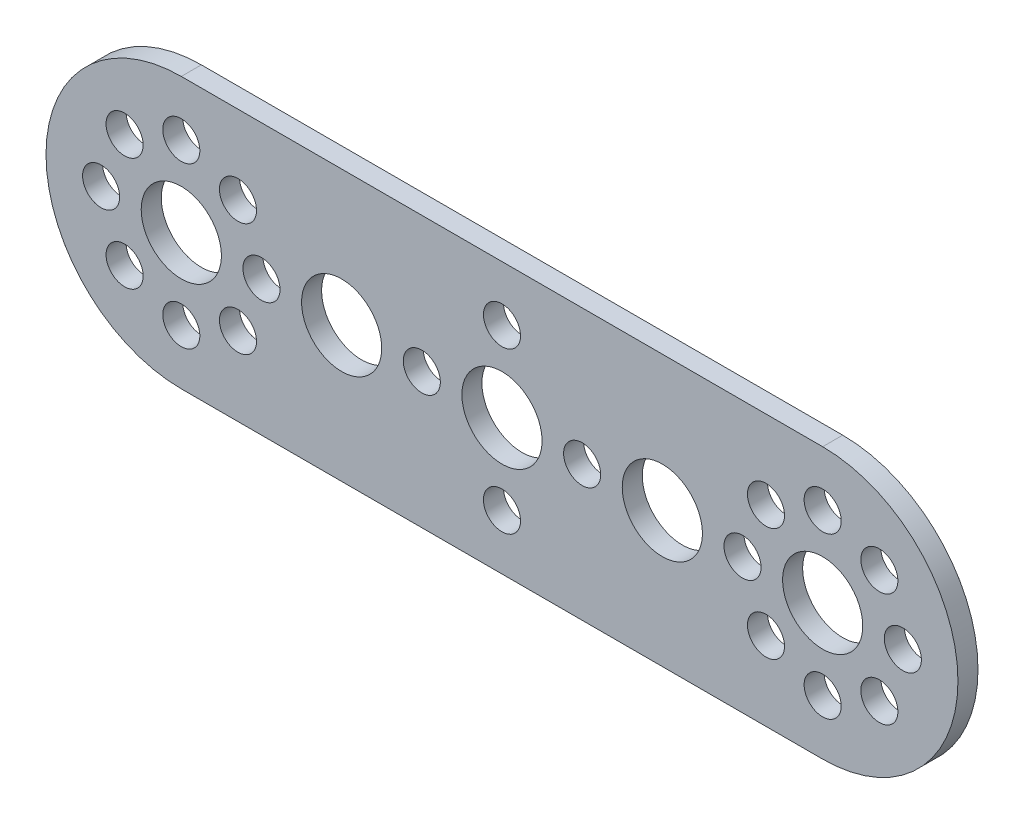
ISO-10303-21;
HEADER;
FILE_DESCRIPTION(('STEP AP214'),'2;1');
FILE_NAME('part.step','',(''),(''),'','','');
FILE_SCHEMA(('AUTOMOTIVE_DESIGN { 1 0 10303 214 1 1 1 1 }'));
ENDSEC;
DATA;
#1=APPLICATION_CONTEXT('core data for automotive mechanical design processes');
#2=APPLICATION_PROTOCOL_DEFINITION('international standard','automotive_design',2000,#1);
#3=PRODUCT_CONTEXT('',#1,'mechanical');
#4=PRODUCT('Part','Part','',(#3));
#5=PRODUCT_RELATED_PRODUCT_CATEGORY('part','',(#4));
#6=PRODUCT_DEFINITION_FORMATION('','',#4);
#7=PRODUCT_DEFINITION_CONTEXT('part definition',#1,'design');
#8=PRODUCT_DEFINITION('design','',#6,#7);
#9=PRODUCT_DEFINITION_SHAPE('','',#8);
#10=(LENGTH_UNIT() NAMED_UNIT(*) SI_UNIT(.MILLI.,.METRE.));
#11=(NAMED_UNIT(*) PLANE_ANGLE_UNIT() SI_UNIT($,.RADIAN.));
#12=(NAMED_UNIT(*) SI_UNIT($,.STERADIAN.) SOLID_ANGLE_UNIT());
#13=UNCERTAINTY_MEASURE_WITH_UNIT(LENGTH_MEASURE(1.E-05),#10,'distance_accuracy_value','');
#14=(GEOMETRIC_REPRESENTATION_CONTEXT(3) GLOBAL_UNCERTAINTY_ASSIGNED_CONTEXT((#13)) GLOBAL_UNIT_ASSIGNED_CONTEXT((#10,
#11,#12)) REPRESENTATION_CONTEXT('',''));
#15=CARTESIAN_POINT('',(0.,0.,0.));
#16=DIRECTION('',(0.,0.,1.));
#17=DIRECTION('',(1.,0.,0.));
#18=AXIS2_PLACEMENT_3D('',#15,#16,#17);
#19=CARTESIAN_POINT('',(-32.,0.,0.));
#20=DIRECTION('',(0.,0.,1.));
#21=DIRECTION('',(1.,0.,0.));
#22=AXIS2_PLACEMENT_3D('',#19,#20,#21);
#23=PLANE('',#22);
#24=CARTESIAN_POINT('',(37.6568542494924,-5.65685424949238,0.));
#25=DIRECTION('',(0.,0.,-1.));
#26=DIRECTION('',(-1.,0.,0.));
#27=AXIS2_PLACEMENT_3D('',#24,#25,#26);
#28=CIRCLE('',#27,1.85);
#29=CARTESIAN_POINT('',(35.8068542494924,-5.65685424949238,0.));
#30=VERTEX_POINT('',#29);
#31=EDGE_CURVE('E159',#30,#30,#28,.F.);
#32=ORIENTED_EDGE('',*,*,#31,.T.);
#33=EDGE_LOOP('',(#32));
#34=FACE_BOUND('',#33,.T.);
#35=CARTESIAN_POINT('',(26.3431457505076,5.65685424949238,0.));
#36=DIRECTION('',(0.,0.,-1.));
#37=DIRECTION('',(-1.,0.,0.));
#38=AXIS2_PLACEMENT_3D('',#35,#36,#37);
#39=CIRCLE('',#38,1.85);
#40=CARTESIAN_POINT('',(24.4931457505076,5.65685424949238,0.));
#41=VERTEX_POINT('',#40);
#42=EDGE_CURVE('E162',#41,#41,#39,.F.);
#43=ORIENTED_EDGE('',*,*,#42,.T.);
#44=EDGE_LOOP('',(#43));
#45=FACE_BOUND('',#44,.T.);
#46=CARTESIAN_POINT('',(-26.3431457505076,5.65685424949239,0.));
#47=DIRECTION('',(0.,0.,-1.));
#48=DIRECTION('',(-1.,0.,0.));
#49=AXIS2_PLACEMENT_3D('',#46,#47,#48);
#50=CIRCLE('',#49,1.85);
#51=CARTESIAN_POINT('',(-28.1931457505076,5.65685424949239,0.));
#52=VERTEX_POINT('',#51);
#53=EDGE_CURVE('E165',#52,#52,#50,.F.);
#54=ORIENTED_EDGE('',*,*,#53,.T.);
#55=EDGE_LOOP('',(#54));
#56=FACE_BOUND('',#55,.T.);
#57=CARTESIAN_POINT('',(26.3431457505076,-5.65685424949239,0.));
#58=DIRECTION('',(0.,0.,-1.));
#59=DIRECTION('',(-1.,0.,0.));
#60=AXIS2_PLACEMENT_3D('',#57,#58,#59);
#61=CIRCLE('',#60,1.85000000000001);
#62=CARTESIAN_POINT('',(24.4931457505076,-5.65685424949239,0.));
#63=VERTEX_POINT('',#62);
#64=EDGE_CURVE('E168',#63,#63,#61,.F.);
#65=ORIENTED_EDGE('',*,*,#64,.T.);
#66=EDGE_LOOP('',(#65));
#67=FACE_BOUND('',#66,.T.);
#68=CARTESIAN_POINT('',(16.,0.,0.));
#69=DIRECTION('',(0.,0.,-1.));
#70=DIRECTION('',(-1.,0.,0.));
#71=AXIS2_PLACEMENT_3D('',#68,#69,#70);
#72=CIRCLE('',#71,4.);
#73=CARTESIAN_POINT('',(12.,0.,0.));
#74=VERTEX_POINT('',#73);
#75=EDGE_CURVE('E171',#74,#74,#72,.F.);
#76=ORIENTED_EDGE('',*,*,#75,.T.);
#77=EDGE_LOOP('',(#76));
#78=FACE_BOUND('',#77,.T.);
#79=CARTESIAN_POINT('',(0.,0.,0.));
#80=DIRECTION('',(0.,0.,-1.));
#81=DIRECTION('',(-1.,0.,0.));
#82=AXIS2_PLACEMENT_3D('',#79,#80,#81);
#83=CIRCLE('',#82,4.);
#84=CARTESIAN_POINT('',(-4.,0.,0.));
#85=VERTEX_POINT('',#84);
#86=EDGE_CURVE('E174',#85,#85,#83,.F.);
#87=ORIENTED_EDGE('',*,*,#86,.T.);
#88=EDGE_LOOP('',(#87));
#89=FACE_BOUND('',#88,.T.);
#90=CARTESIAN_POINT('',(0.,8.,0.));
#91=DIRECTION('',(0.,0.,-1.));
#92=DIRECTION('',(-1.,0.,0.));
#93=AXIS2_PLACEMENT_3D('',#90,#91,#92);
#94=CIRCLE('',#93,1.85);
#95=CARTESIAN_POINT('',(-1.85,8.,0.));
#96=VERTEX_POINT('',#95);
#97=EDGE_CURVE('E177',#96,#96,#94,.F.);
#98=ORIENTED_EDGE('',*,*,#97,.T.);
#99=EDGE_LOOP('',(#98));
#100=FACE_BOUND('',#99,.T.);
#101=CARTESIAN_POINT('',(-8.,0.,0.));
#102=DIRECTION('',(0.,0.,-1.));
#103=DIRECTION('',(-1.,0.,0.));
#104=AXIS2_PLACEMENT_3D('',#101,#102,#103);
#105=CIRCLE('',#104,1.85);
#106=CARTESIAN_POINT('',(-9.85,0.,0.));
#107=VERTEX_POINT('',#106);
#108=EDGE_CURVE('E180',#107,#107,#105,.F.);
#109=ORIENTED_EDGE('',*,*,#108,.T.);
#110=EDGE_LOOP('',(#109));
#111=FACE_BOUND('',#110,.T.);
#112=CARTESIAN_POINT('',(-32.,-8.,0.));
#113=DIRECTION('',(0.,0.,-1.));
#114=DIRECTION('',(-1.,0.,0.));
#115=AXIS2_PLACEMENT_3D('',#112,#113,#114);
#116=CIRCLE('',#115,1.85);
#117=CARTESIAN_POINT('',(-33.85,-8.,0.));
#118=VERTEX_POINT('',#117);
#119=EDGE_CURVE('E183',#118,#118,#116,.F.);
#120=ORIENTED_EDGE('',*,*,#119,.T.);
#121=EDGE_LOOP('',(#120));
#122=FACE_BOUND('',#121,.T.);
#123=CARTESIAN_POINT('',(24.,0.,0.));
#124=DIRECTION('',(0.,0.,-1.));
#125=DIRECTION('',(-1.,0.,0.));
#126=AXIS2_PLACEMENT_3D('',#123,#124,#125);
#127=CIRCLE('',#126,1.85);
#128=CARTESIAN_POINT('',(22.15,0.,0.));
#129=VERTEX_POINT('',#128);
#130=EDGE_CURVE('E186',#129,#129,#127,.F.);
#131=ORIENTED_EDGE('',*,*,#130,.T.);
#132=EDGE_LOOP('',(#131));
#133=FACE_BOUND('',#132,.T.);
#134=CARTESIAN_POINT('',(32.,-8.,0.));
#135=DIRECTION('',(0.,0.,-1.));
#136=DIRECTION('',(-1.,0.,0.));
#137=AXIS2_PLACEMENT_3D('',#134,#135,#136);
#138=CIRCLE('',#137,1.85);
#139=CARTESIAN_POINT('',(30.15,-8.,0.));
#140=VERTEX_POINT('',#139);
#141=EDGE_CURVE('E189',#140,#140,#138,.F.);
#142=ORIENTED_EDGE('',*,*,#141,.T.);
#143=EDGE_LOOP('',(#142));
#144=FACE_BOUND('',#143,.T.);
#145=CARTESIAN_POINT('',(-32.,8.,0.));
#146=DIRECTION('',(0.,0.,-1.));
#147=DIRECTION('',(-1.,0.,0.));
#148=AXIS2_PLACEMENT_3D('',#145,#146,#147);
#149=CIRCLE('',#148,1.85);
#150=CARTESIAN_POINT('',(-33.85,8.,0.));
#151=VERTEX_POINT('',#150);
#152=EDGE_CURVE('E192',#151,#151,#149,.F.);
#153=ORIENTED_EDGE('',*,*,#152,.T.);
#154=EDGE_LOOP('',(#153));
#155=FACE_BOUND('',#154,.T.);
#156=CARTESIAN_POINT('',(-32.,0.,0.));
#157=DIRECTION('',(0.,0.,-1.));
#158=DIRECTION('',(-1.,0.,0.));
#159=AXIS2_PLACEMENT_3D('',#156,#157,#158);
#160=CIRCLE('',#159,4.);
#161=CARTESIAN_POINT('',(-36.,0.,0.));
#162=VERTEX_POINT('',#161);
#163=EDGE_CURVE('E195',#162,#162,#160,.F.);
#164=ORIENTED_EDGE('',*,*,#163,.T.);
#165=EDGE_LOOP('',(#164));
#166=FACE_BOUND('',#165,.T.);
#167=CARTESIAN_POINT('',(32.,0.,0.));
#168=DIRECTION('',(0.,0.,-1.));
#169=DIRECTION('',(-1.,0.,0.));
#170=AXIS2_PLACEMENT_3D('',#167,#168,#169);
#171=CIRCLE('',#170,4.);
#172=CARTESIAN_POINT('',(28.,0.,0.));
#173=VERTEX_POINT('',#172);
#174=EDGE_CURVE('E198',#173,#173,#171,.F.);
#175=ORIENTED_EDGE('',*,*,#174,.T.);
#176=EDGE_LOOP('',(#175));
#177=FACE_BOUND('',#176,.T.);
#178=CARTESIAN_POINT('',(32.,8.,0.));
#179=DIRECTION('',(0.,0.,-1.));
#180=DIRECTION('',(-1.,0.,0.));
#181=AXIS2_PLACEMENT_3D('',#178,#179,#180);
#182=CIRCLE('',#181,1.85);
#183=CARTESIAN_POINT('',(30.15,8.,0.));
#184=VERTEX_POINT('',#183);
#185=EDGE_CURVE('E201',#184,#184,#182,.F.);
#186=ORIENTED_EDGE('',*,*,#185,.T.);
#187=EDGE_LOOP('',(#186));
#188=FACE_BOUND('',#187,.T.);
#189=CARTESIAN_POINT('',(40.,0.,0.));
#190=DIRECTION('',(0.,0.,-1.));
#191=DIRECTION('',(-1.,0.,0.));
#192=AXIS2_PLACEMENT_3D('',#189,#190,#191);
#193=CIRCLE('',#192,1.85);
#194=CARTESIAN_POINT('',(38.15,0.,0.));
#195=VERTEX_POINT('',#194);
#196=EDGE_CURVE('E204',#195,#195,#193,.F.);
#197=ORIENTED_EDGE('',*,*,#196,.T.);
#198=EDGE_LOOP('',(#197));
#199=FACE_BOUND('',#198,.T.);
#200=CARTESIAN_POINT('',(-24.,0.,0.));
#201=DIRECTION('',(0.,0.,-1.));
#202=DIRECTION('',(-1.,0.,0.));
#203=AXIS2_PLACEMENT_3D('',#200,#201,#202);
#204=CIRCLE('',#203,1.85);
#205=CARTESIAN_POINT('',(-25.85,0.,0.));
#206=VERTEX_POINT('',#205);
#207=EDGE_CURVE('E207',#206,#206,#204,.F.);
#208=ORIENTED_EDGE('',*,*,#207,.T.);
#209=EDGE_LOOP('',(#208));
#210=FACE_BOUND('',#209,.T.);
#211=CARTESIAN_POINT('',(-40.,0.,0.));
#212=DIRECTION('',(0.,0.,-1.));
#213=DIRECTION('',(-1.,0.,0.));
#214=AXIS2_PLACEMENT_3D('',#211,#212,#213);
#215=CIRCLE('',#214,1.85);
#216=CARTESIAN_POINT('',(-41.85,0.,0.));
#217=VERTEX_POINT('',#216);
#218=EDGE_CURVE('E210',#217,#217,#215,.F.);
#219=ORIENTED_EDGE('',*,*,#218,.T.);
#220=EDGE_LOOP('',(#219));
#221=FACE_BOUND('',#220,.T.);
#222=CARTESIAN_POINT('',(8.,0.,0.));
#223=DIRECTION('',(0.,0.,-1.));
#224=DIRECTION('',(-1.,0.,0.));
#225=AXIS2_PLACEMENT_3D('',#222,#223,#224);
#226=CIRCLE('',#225,1.85);
#227=CARTESIAN_POINT('',(6.15,0.,0.));
#228=VERTEX_POINT('',#227);
#229=EDGE_CURVE('E213',#228,#228,#226,.F.);
#230=ORIENTED_EDGE('',*,*,#229,.T.);
#231=EDGE_LOOP('',(#230));
#232=FACE_BOUND('',#231,.T.);
#233=CARTESIAN_POINT('',(0.,-8.,0.));
#234=DIRECTION('',(0.,0.,-1.));
#235=DIRECTION('',(-1.,0.,0.));
#236=AXIS2_PLACEMENT_3D('',#233,#234,#235);
#237=CIRCLE('',#236,1.85);
#238=CARTESIAN_POINT('',(-1.85,-8.,0.));
#239=VERTEX_POINT('',#238);
#240=EDGE_CURVE('E216',#239,#239,#237,.F.);
#241=ORIENTED_EDGE('',*,*,#240,.T.);
#242=EDGE_LOOP('',(#241));
#243=FACE_BOUND('',#242,.T.);
#244=CARTESIAN_POINT('',(-16.,0.,0.));
#245=DIRECTION('',(0.,0.,-1.));
#246=DIRECTION('',(-1.,0.,0.));
#247=AXIS2_PLACEMENT_3D('',#244,#245,#246);
#248=CIRCLE('',#247,4.);
#249=CARTESIAN_POINT('',(-20.,0.,0.));
#250=VERTEX_POINT('',#249);
#251=EDGE_CURVE('E219',#250,#250,#248,.F.);
#252=ORIENTED_EDGE('',*,*,#251,.T.);
#253=EDGE_LOOP('',(#252));
#254=FACE_BOUND('',#253,.T.);
#255=CARTESIAN_POINT('',(-37.6568542494924,-5.65685424949239,0.));
#256=DIRECTION('',(0.,0.,-1.));
#257=DIRECTION('',(-1.,0.,0.));
#258=AXIS2_PLACEMENT_3D('',#255,#256,#257);
#259=CIRCLE('',#258,1.85);
#260=CARTESIAN_POINT('',(-39.5068542494924,-5.65685424949239,0.));
#261=VERTEX_POINT('',#260);
#262=EDGE_CURVE('E222',#261,#261,#259,.F.);
#263=ORIENTED_EDGE('',*,*,#262,.T.);
#264=EDGE_LOOP('',(#263));
#265=FACE_BOUND('',#264,.T.);
#266=CARTESIAN_POINT('',(-37.6568542494924,5.65685424949237,0.));
#267=DIRECTION('',(0.,0.,-1.));
#268=DIRECTION('',(-1.,0.,0.));
#269=AXIS2_PLACEMENT_3D('',#266,#267,#268);
#270=CIRCLE('',#269,1.85);
#271=CARTESIAN_POINT('',(-39.5068542494924,5.65685424949237,0.));
#272=VERTEX_POINT('',#271);
#273=EDGE_CURVE('E225',#272,#272,#270,.F.);
#274=ORIENTED_EDGE('',*,*,#273,.T.);
#275=EDGE_LOOP('',(#274));
#276=FACE_BOUND('',#275,.T.);
#277=CARTESIAN_POINT('',(-26.3431457505076,-5.65685424949237,0.));
#278=DIRECTION('',(0.,0.,-1.));
#279=DIRECTION('',(-1.,0.,0.));
#280=AXIS2_PLACEMENT_3D('',#277,#278,#279);
#281=CIRCLE('',#280,1.85);
#282=CARTESIAN_POINT('',(-28.1931457505076,-5.65685424949237,0.));
#283=VERTEX_POINT('',#282);
#284=EDGE_CURVE('E228',#283,#283,#281,.F.);
#285=ORIENTED_EDGE('',*,*,#284,.T.);
#286=EDGE_LOOP('',(#285));
#287=FACE_BOUND('',#286,.T.);
#288=CARTESIAN_POINT('',(37.6568542494924,5.65685424949239,0.));
#289=DIRECTION('',(0.,0.,-1.));
#290=DIRECTION('',(-1.,0.,0.));
#291=AXIS2_PLACEMENT_3D('',#288,#289,#290);
#292=CIRCLE('',#291,1.85);
#293=CARTESIAN_POINT('',(35.8068542494924,5.65685424949239,0.));
#294=VERTEX_POINT('',#293);
#295=EDGE_CURVE('E231',#294,#294,#292,.F.);
#296=ORIENTED_EDGE('',*,*,#295,.T.);
#297=EDGE_LOOP('',(#296));
#298=FACE_BOUND('',#297,.T.);
#299=DIRECTION('',(1.,0.,0.));
#300=VECTOR('',#299,1.);
#301=CARTESIAN_POINT('',(-32.,13.5,0.));
#302=LINE('',#301,#300);
#303=CARTESIAN_POINT('',(-32.,13.5,0.));
#304=VERTEX_POINT('',#303);
#305=CARTESIAN_POINT('',(32.,13.5,0.));
#306=VERTEX_POINT('',#305);
#307=EDGE_CURVE('E58',#304,#306,#302,.T.);
#308=ORIENTED_EDGE('',*,*,#307,.T.);
#309=CARTESIAN_POINT('',(32.,0.,0.));
#310=DIRECTION('',(0.,0.,-1.));
#311=DIRECTION('',(-1.,0.,0.));
#312=AXIS2_PLACEMENT_3D('',#309,#310,#311);
#313=CIRCLE('',#312,13.5);
#314=CARTESIAN_POINT('',(32.,-13.5,0.));
#315=VERTEX_POINT('',#314);
#316=EDGE_CURVE('E18',#315,#306,#313,.F.);
#317=ORIENTED_EDGE('',*,*,#316,.F.);
#318=DIRECTION('',(1.,0.,0.));
#319=VECTOR('',#318,1.);
#320=CARTESIAN_POINT('',(-32.,-13.5,0.));
#321=LINE('',#320,#319);
#322=CARTESIAN_POINT('',(-32.,-13.5,0.));
#323=VERTEX_POINT('',#322);
#324=EDGE_CURVE('E53',#315,#323,#321,.F.);
#325=ORIENTED_EDGE('',*,*,#324,.T.);
#326=CARTESIAN_POINT('',(-32.,0.,0.));
#327=DIRECTION('',(0.,0.,-1.));
#328=DIRECTION('',(-1.,0.,0.));
#329=AXIS2_PLACEMENT_3D('',#326,#327,#328);
#330=CIRCLE('',#329,13.5);
#331=EDGE_CURVE('E61',#304,#323,#330,.F.);
#332=ORIENTED_EDGE('',*,*,#331,.F.);
#333=EDGE_LOOP('',(#308,#317,#325,#332));
#334=FACE_BOUND('',#333,.T.);
#335=ADVANCED_FACE('F15',(#34,#45,#56,#67,#78,#89,#100,#111,#122,#133,#144,#155,#166,#177,#188,
#199,#210,#221,#232,#243,#254,#265,#276,#287,#298,#334),#23,.F.);
#336=CARTESIAN_POINT('',(-32.,-13.5,2.));
#337=DIRECTION('',(0.,1.,0.));
#338=DIRECTION('',(0.,0.,1.));
#339=AXIS2_PLACEMENT_3D('',#336,#337,#338);
#340=PLANE('',#339);
#341=DIRECTION('',(1.,0.,0.));
#342=VECTOR('',#341,1.);
#343=CARTESIAN_POINT('',(-32.,-13.5,2.));
#344=LINE('',#343,#342);
#345=CARTESIAN_POINT('',(-32.,-13.5,2.));
#346=VERTEX_POINT('',#345);
#347=CARTESIAN_POINT('',(32.,-13.5,2.));
#348=VERTEX_POINT('',#347);
#349=EDGE_CURVE('E157',#346,#348,#344,.T.);
#350=ORIENTED_EDGE('',*,*,#349,.F.);
#351=DIRECTION('',(0.,0.,-1.));
#352=VECTOR('',#351,1.);
#353=CARTESIAN_POINT('',(-32.,-13.5,2.));
#354=LINE('',#353,#352);
#355=EDGE_CURVE('E75',#323,#346,#354,.F.);
#356=ORIENTED_EDGE('',*,*,#355,.F.);
#357=ORIENTED_EDGE('',*,*,#324,.F.);
#358=DIRECTION('',(0.,0.,-1.));
#359=VECTOR('',#358,1.);
#360=CARTESIAN_POINT('',(32.,-13.5,2.));
#361=LINE('',#360,#359);
#362=EDGE_CURVE('E70',#348,#315,#361,.T.);
#363=ORIENTED_EDGE('',*,*,#362,.F.);
#364=EDGE_LOOP('',(#350,#356,#357,#363));
#365=FACE_BOUND('',#364,.T.);
#366=ADVANCED_FACE('F239',(#365),#340,.F.);
#367=CARTESIAN_POINT('',(32.,0.,2.));
#368=DIRECTION('',(0.,0.,-1.));
#369=DIRECTION('',(-1.,0.,0.));
#370=AXIS2_PLACEMENT_3D('',#367,#368,#369);
#371=CYLINDRICAL_SURFACE('',#370,13.5);
#372=ORIENTED_EDGE('',*,*,#362,.T.);
#373=ORIENTED_EDGE('',*,*,#316,.T.);
#374=DIRECTION('',(0.,0.,-1.));
#375=VECTOR('',#374,1.);
#376=CARTESIAN_POINT('',(32.,13.5,2.));
#377=LINE('',#376,#375);
#378=CARTESIAN_POINT('',(32.,13.5,2.));
#379=VERTEX_POINT('',#378);
#380=EDGE_CURVE('E64',#306,#379,#377,.F.);
#381=ORIENTED_EDGE('',*,*,#380,.T.);
#382=CARTESIAN_POINT('',(32.,0.,2.));
#383=DIRECTION('',(0.,0.,-1.));
#384=DIRECTION('',(-1.,0.,0.));
#385=AXIS2_PLACEMENT_3D('',#382,#383,#384);
#386=CIRCLE('',#385,13.5);
#387=EDGE_CURVE('E155',#348,#379,#386,.F.);
#388=ORIENTED_EDGE('',*,*,#387,.F.);
#389=EDGE_LOOP('',(#372,#373,#381,#388));
#390=FACE_BOUND('',#389,.T.);
#391=ADVANCED_FACE('F67',(#390),#371,.T.);
#392=CARTESIAN_POINT('',(-32.,13.5,2.));
#393=DIRECTION('',(0.,-1.,0.));
#394=DIRECTION('',(0.,0.,-1.));
#395=AXIS2_PLACEMENT_3D('',#392,#393,#394);
#396=PLANE('',#395);
#397=DIRECTION('',(1.,0.,0.));
#398=VECTOR('',#397,1.);
#399=CARTESIAN_POINT('',(-32.,13.5,2.));
#400=LINE('',#399,#398);
#401=CARTESIAN_POINT('',(-32.,13.5,2.));
#402=VERTEX_POINT('',#401);
#403=EDGE_CURVE('E73',#379,#402,#400,.F.);
#404=ORIENTED_EDGE('',*,*,#403,.F.);
#405=ORIENTED_EDGE('',*,*,#380,.F.);
#406=ORIENTED_EDGE('',*,*,#307,.F.);
#407=DIRECTION('',(0.,0.,-1.));
#408=VECTOR('',#407,1.);
#409=CARTESIAN_POINT('',(-32.,13.5,2.));
#410=LINE('',#409,#408);
#411=EDGE_CURVE('E77',#402,#304,#410,.T.);
#412=ORIENTED_EDGE('',*,*,#411,.F.);
#413=EDGE_LOOP('',(#404,#405,#406,#412));
#414=FACE_BOUND('',#413,.T.);
#415=ADVANCED_FACE('F71',(#414),#396,.F.);
#416=CARTESIAN_POINT('',(-32.,0.,2.));
#417=DIRECTION('',(0.,0.,-1.));
#418=DIRECTION('',(-1.,0.,0.));
#419=AXIS2_PLACEMENT_3D('',#416,#417,#418);
#420=CYLINDRICAL_SURFACE('',#419,13.5);
#421=ORIENTED_EDGE('',*,*,#411,.T.);
#422=ORIENTED_EDGE('',*,*,#331,.T.);
#423=ORIENTED_EDGE('',*,*,#355,.T.);
#424=CARTESIAN_POINT('',(-32.,0.,2.));
#425=DIRECTION('',(0.,0.,-1.));
#426=DIRECTION('',(-1.,0.,0.));
#427=AXIS2_PLACEMENT_3D('',#424,#425,#426);
#428=CIRCLE('',#427,13.5);
#429=EDGE_CURVE('E33',#402,#346,#428,.F.);
#430=ORIENTED_EDGE('',*,*,#429,.F.);
#431=EDGE_LOOP('',(#421,#422,#423,#430));
#432=FACE_BOUND('',#431,.T.);
#433=ADVANCED_FACE('F233',(#432),#420,.T.);
#434=CARTESIAN_POINT('',(37.6568542494924,5.65685424949239,2.));
#435=DIRECTION('',(0.,0.,-1.));
#436=DIRECTION('',(-1.,0.,0.));
#437=AXIS2_PLACEMENT_3D('',#434,#435,#436);
#438=CYLINDRICAL_SURFACE('',#437,1.85);
#439=ORIENTED_EDGE('',*,*,#295,.F.);
#440=EDGE_LOOP('',(#439));
#441=FACE_BOUND('',#440,.T.);
#442=CARTESIAN_POINT('',(37.6568542494924,5.65685424949239,2.));
#443=DIRECTION('',(0.,0.,-1.));
#444=DIRECTION('',(-1.,0.,0.));
#445=AXIS2_PLACEMENT_3D('',#442,#443,#444);
#446=CIRCLE('',#445,1.85);
#447=CARTESIAN_POINT('',(35.8068542494924,5.65685424949239,2.));
#448=VERTEX_POINT('',#447);
#449=EDGE_CURVE('E152',#448,#448,#446,.T.);
#450=ORIENTED_EDGE('',*,*,#449,.F.);
#451=EDGE_LOOP('',(#450));
#452=FACE_BOUND('',#451,.T.);
#453=ADVANCED_FACE('F350',(#441,#452),#438,.F.);
#454=CARTESIAN_POINT('',(-26.3431457505076,-5.65685424949237,2.));
#455=DIRECTION('',(0.,0.,-1.));
#456=DIRECTION('',(-1.,0.,0.));
#457=AXIS2_PLACEMENT_3D('',#454,#455,#456);
#458=CYLINDRICAL_SURFACE('',#457,1.85);
#459=ORIENTED_EDGE('',*,*,#284,.F.);
#460=EDGE_LOOP('',(#459));
#461=FACE_BOUND('',#460,.T.);
#462=CARTESIAN_POINT('',(-26.3431457505076,-5.65685424949237,2.));
#463=DIRECTION('',(0.,0.,-1.));
#464=DIRECTION('',(-1.,0.,0.));
#465=AXIS2_PLACEMENT_3D('',#462,#463,#464);
#466=CIRCLE('',#465,1.85);
#467=CARTESIAN_POINT('',(-28.1931457505076,-5.65685424949237,2.));
#468=VERTEX_POINT('',#467);
#469=EDGE_CURVE('E149',#468,#468,#466,.T.);
#470=ORIENTED_EDGE('',*,*,#469,.F.);
#471=EDGE_LOOP('',(#470));
#472=FACE_BOUND('',#471,.T.);
#473=ADVANCED_FACE('F346',(#461,#472),#458,.F.);
#474=CARTESIAN_POINT('',(-37.6568542494924,5.65685424949237,2.));
#475=DIRECTION('',(0.,0.,-1.));
#476=DIRECTION('',(-1.,0.,0.));
#477=AXIS2_PLACEMENT_3D('',#474,#475,#476);
#478=CYLINDRICAL_SURFACE('',#477,1.85);
#479=ORIENTED_EDGE('',*,*,#273,.F.);
#480=EDGE_LOOP('',(#479));
#481=FACE_BOUND('',#480,.T.);
#482=CARTESIAN_POINT('',(-37.6568542494924,5.65685424949237,2.));
#483=DIRECTION('',(0.,0.,-1.));
#484=DIRECTION('',(-1.,0.,0.));
#485=AXIS2_PLACEMENT_3D('',#482,#483,#484);
#486=CIRCLE('',#485,1.85);
#487=CARTESIAN_POINT('',(-39.5068542494924,5.65685424949237,2.));
#488=VERTEX_POINT('',#487);
#489=EDGE_CURVE('E146',#488,#488,#486,.T.);
#490=ORIENTED_EDGE('',*,*,#489,.F.);
#491=EDGE_LOOP('',(#490));
#492=FACE_BOUND('',#491,.T.);
#493=ADVANCED_FACE('F342',(#481,#492),#478,.F.);
#494=CARTESIAN_POINT('',(-37.6568542494924,-5.65685424949239,2.));
#495=DIRECTION('',(0.,0.,-1.));
#496=DIRECTION('',(-1.,0.,0.));
#497=AXIS2_PLACEMENT_3D('',#494,#495,#496);
#498=CYLINDRICAL_SURFACE('',#497,1.85);
#499=ORIENTED_EDGE('',*,*,#262,.F.);
#500=EDGE_LOOP('',(#499));
#501=FACE_BOUND('',#500,.T.);
#502=CARTESIAN_POINT('',(-37.6568542494924,-5.65685424949239,2.));
#503=DIRECTION('',(0.,0.,-1.));
#504=DIRECTION('',(-1.,0.,0.));
#505=AXIS2_PLACEMENT_3D('',#502,#503,#504);
#506=CIRCLE('',#505,1.85);
#507=CARTESIAN_POINT('',(-39.5068542494924,-5.65685424949239,2.));
#508=VERTEX_POINT('',#507);
#509=EDGE_CURVE('E143',#508,#508,#506,.T.);
#510=ORIENTED_EDGE('',*,*,#509,.F.);
#511=EDGE_LOOP('',(#510));
#512=FACE_BOUND('',#511,.T.);
#513=ADVANCED_FACE('F338',(#501,#512),#498,.F.);
#514=CARTESIAN_POINT('',(-16.,0.,2.));
#515=DIRECTION('',(0.,0.,-1.));
#516=DIRECTION('',(-1.,0.,0.));
#517=AXIS2_PLACEMENT_3D('',#514,#515,#516);
#518=CYLINDRICAL_SURFACE('',#517,4.);
#519=ORIENTED_EDGE('',*,*,#251,.F.);
#520=EDGE_LOOP('',(#519));
#521=FACE_BOUND('',#520,.T.);
#522=CARTESIAN_POINT('',(-16.,0.,2.));
#523=DIRECTION('',(0.,0.,-1.));
#524=DIRECTION('',(-1.,0.,0.));
#525=AXIS2_PLACEMENT_3D('',#522,#523,#524);
#526=CIRCLE('',#525,4.);
#527=CARTESIAN_POINT('',(-20.,0.,2.));
#528=VERTEX_POINT('',#527);
#529=EDGE_CURVE('E140',#528,#528,#526,.T.);
#530=ORIENTED_EDGE('',*,*,#529,.F.);
#531=EDGE_LOOP('',(#530));
#532=FACE_BOUND('',#531,.T.);
#533=ADVANCED_FACE('F334',(#521,#532),#518,.F.);
#534=CARTESIAN_POINT('',(0.,-8.,2.));
#535=DIRECTION('',(0.,0.,-1.));
#536=DIRECTION('',(-1.,0.,0.));
#537=AXIS2_PLACEMENT_3D('',#534,#535,#536);
#538=CYLINDRICAL_SURFACE('',#537,1.85);
#539=ORIENTED_EDGE('',*,*,#240,.F.);
#540=EDGE_LOOP('',(#539));
#541=FACE_BOUND('',#540,.T.);
#542=CARTESIAN_POINT('',(0.,-8.,2.));
#543=DIRECTION('',(0.,0.,-1.));
#544=DIRECTION('',(-1.,0.,0.));
#545=AXIS2_PLACEMENT_3D('',#542,#543,#544);
#546=CIRCLE('',#545,1.85);
#547=CARTESIAN_POINT('',(-1.85,-8.,2.));
#548=VERTEX_POINT('',#547);
#549=EDGE_CURVE('E137',#548,#548,#546,.T.);
#550=ORIENTED_EDGE('',*,*,#549,.F.);
#551=EDGE_LOOP('',(#550));
#552=FACE_BOUND('',#551,.T.);
#553=ADVANCED_FACE('F330',(#541,#552),#538,.F.);
#554=CARTESIAN_POINT('',(8.,0.,2.));
#555=DIRECTION('',(0.,0.,-1.));
#556=DIRECTION('',(-1.,0.,0.));
#557=AXIS2_PLACEMENT_3D('',#554,#555,#556);
#558=CYLINDRICAL_SURFACE('',#557,1.85);
#559=ORIENTED_EDGE('',*,*,#229,.F.);
#560=EDGE_LOOP('',(#559));
#561=FACE_BOUND('',#560,.T.);
#562=CARTESIAN_POINT('',(8.,0.,2.));
#563=DIRECTION('',(0.,0.,-1.));
#564=DIRECTION('',(-1.,0.,0.));
#565=AXIS2_PLACEMENT_3D('',#562,#563,#564);
#566=CIRCLE('',#565,1.85);
#567=CARTESIAN_POINT('',(6.15,0.,2.));
#568=VERTEX_POINT('',#567);
#569=EDGE_CURVE('E134',#568,#568,#566,.T.);
#570=ORIENTED_EDGE('',*,*,#569,.F.);
#571=EDGE_LOOP('',(#570));
#572=FACE_BOUND('',#571,.T.);
#573=ADVANCED_FACE('F326',(#561,#572),#558,.F.);
#574=CARTESIAN_POINT('',(-40.,0.,2.));
#575=DIRECTION('',(0.,0.,-1.));
#576=DIRECTION('',(-1.,0.,0.));
#577=AXIS2_PLACEMENT_3D('',#574,#575,#576);
#578=CYLINDRICAL_SURFACE('',#577,1.85);
#579=ORIENTED_EDGE('',*,*,#218,.F.);
#580=EDGE_LOOP('',(#579));
#581=FACE_BOUND('',#580,.T.);
#582=CARTESIAN_POINT('',(-40.,0.,2.));
#583=DIRECTION('',(0.,0.,-1.));
#584=DIRECTION('',(-1.,0.,0.));
#585=AXIS2_PLACEMENT_3D('',#582,#583,#584);
#586=CIRCLE('',#585,1.85);
#587=CARTESIAN_POINT('',(-41.85,0.,2.));
#588=VERTEX_POINT('',#587);
#589=EDGE_CURVE('E131',#588,#588,#586,.T.);
#590=ORIENTED_EDGE('',*,*,#589,.F.);
#591=EDGE_LOOP('',(#590));
#592=FACE_BOUND('',#591,.T.);
#593=ADVANCED_FACE('F322',(#581,#592),#578,.F.);
#594=CARTESIAN_POINT('',(-24.,0.,2.));
#595=DIRECTION('',(0.,0.,-1.));
#596=DIRECTION('',(-1.,0.,0.));
#597=AXIS2_PLACEMENT_3D('',#594,#595,#596);
#598=CYLINDRICAL_SURFACE('',#597,1.85);
#599=ORIENTED_EDGE('',*,*,#207,.F.);
#600=EDGE_LOOP('',(#599));
#601=FACE_BOUND('',#600,.T.);
#602=CARTESIAN_POINT('',(-24.,0.,2.));
#603=DIRECTION('',(0.,0.,-1.));
#604=DIRECTION('',(-1.,0.,0.));
#605=AXIS2_PLACEMENT_3D('',#602,#603,#604);
#606=CIRCLE('',#605,1.85);
#607=CARTESIAN_POINT('',(-25.85,0.,2.));
#608=VERTEX_POINT('',#607);
#609=EDGE_CURVE('E128',#608,#608,#606,.T.);
#610=ORIENTED_EDGE('',*,*,#609,.F.);
#611=EDGE_LOOP('',(#610));
#612=FACE_BOUND('',#611,.T.);
#613=ADVANCED_FACE('F318',(#601,#612),#598,.F.);
#614=CARTESIAN_POINT('',(40.,0.,2.));
#615=DIRECTION('',(0.,0.,-1.));
#616=DIRECTION('',(-1.,0.,0.));
#617=AXIS2_PLACEMENT_3D('',#614,#615,#616);
#618=CYLINDRICAL_SURFACE('',#617,1.85);
#619=ORIENTED_EDGE('',*,*,#196,.F.);
#620=EDGE_LOOP('',(#619));
#621=FACE_BOUND('',#620,.T.);
#622=CARTESIAN_POINT('',(40.,0.,2.));
#623=DIRECTION('',(0.,0.,-1.));
#624=DIRECTION('',(-1.,0.,0.));
#625=AXIS2_PLACEMENT_3D('',#622,#623,#624);
#626=CIRCLE('',#625,1.85);
#627=CARTESIAN_POINT('',(38.15,0.,2.));
#628=VERTEX_POINT('',#627);
#629=EDGE_CURVE('E125',#628,#628,#626,.T.);
#630=ORIENTED_EDGE('',*,*,#629,.F.);
#631=EDGE_LOOP('',(#630));
#632=FACE_BOUND('',#631,.T.);
#633=ADVANCED_FACE('F314',(#621,#632),#618,.F.);
#634=CARTESIAN_POINT('',(32.,8.,2.));
#635=DIRECTION('',(0.,0.,-1.));
#636=DIRECTION('',(-1.,0.,0.));
#637=AXIS2_PLACEMENT_3D('',#634,#635,#636);
#638=CYLINDRICAL_SURFACE('',#637,1.85);
#639=ORIENTED_EDGE('',*,*,#185,.F.);
#640=EDGE_LOOP('',(#639));
#641=FACE_BOUND('',#640,.T.);
#642=CARTESIAN_POINT('',(32.,8.,2.));
#643=DIRECTION('',(0.,0.,-1.));
#644=DIRECTION('',(-1.,0.,0.));
#645=AXIS2_PLACEMENT_3D('',#642,#643,#644);
#646=CIRCLE('',#645,1.85);
#647=CARTESIAN_POINT('',(30.15,8.,2.));
#648=VERTEX_POINT('',#647);
#649=EDGE_CURVE('E122',#648,#648,#646,.T.);
#650=ORIENTED_EDGE('',*,*,#649,.F.);
#651=EDGE_LOOP('',(#650));
#652=FACE_BOUND('',#651,.T.);
#653=ADVANCED_FACE('F310',(#641,#652),#638,.F.);
#654=CARTESIAN_POINT('',(32.,0.,2.));
#655=DIRECTION('',(0.,0.,-1.));
#656=DIRECTION('',(-1.,0.,0.));
#657=AXIS2_PLACEMENT_3D('',#654,#655,#656);
#658=CYLINDRICAL_SURFACE('',#657,4.);
#659=ORIENTED_EDGE('',*,*,#174,.F.);
#660=EDGE_LOOP('',(#659));
#661=FACE_BOUND('',#660,.T.);
#662=CARTESIAN_POINT('',(32.,0.,2.));
#663=DIRECTION('',(0.,0.,-1.));
#664=DIRECTION('',(-1.,0.,0.));
#665=AXIS2_PLACEMENT_3D('',#662,#663,#664);
#666=CIRCLE('',#665,4.);
#667=CARTESIAN_POINT('',(28.,0.,2.));
#668=VERTEX_POINT('',#667);
#669=EDGE_CURVE('E119',#668,#668,#666,.T.);
#670=ORIENTED_EDGE('',*,*,#669,.F.);
#671=EDGE_LOOP('',(#670));
#672=FACE_BOUND('',#671,.T.);
#673=ADVANCED_FACE('F306',(#661,#672),#658,.F.);
#674=CARTESIAN_POINT('',(-32.,0.,2.));
#675=DIRECTION('',(0.,0.,-1.));
#676=DIRECTION('',(-1.,0.,0.));
#677=AXIS2_PLACEMENT_3D('',#674,#675,#676);
#678=CYLINDRICAL_SURFACE('',#677,4.);
#679=ORIENTED_EDGE('',*,*,#163,.F.);
#680=EDGE_LOOP('',(#679));
#681=FACE_BOUND('',#680,.T.);
#682=CARTESIAN_POINT('',(-32.,0.,2.));
#683=DIRECTION('',(0.,0.,-1.));
#684=DIRECTION('',(-1.,0.,0.));
#685=AXIS2_PLACEMENT_3D('',#682,#683,#684);
#686=CIRCLE('',#685,4.);
#687=CARTESIAN_POINT('',(-36.,0.,2.));
#688=VERTEX_POINT('',#687);
#689=EDGE_CURVE('E116',#688,#688,#686,.T.);
#690=ORIENTED_EDGE('',*,*,#689,.F.);
#691=EDGE_LOOP('',(#690));
#692=FACE_BOUND('',#691,.T.);
#693=ADVANCED_FACE('F302',(#681,#692),#678,.F.);
#694=CARTESIAN_POINT('',(-32.,8.,2.));
#695=DIRECTION('',(0.,0.,-1.));
#696=DIRECTION('',(-1.,0.,0.));
#697=AXIS2_PLACEMENT_3D('',#694,#695,#696);
#698=CYLINDRICAL_SURFACE('',#697,1.85);
#699=ORIENTED_EDGE('',*,*,#152,.F.);
#700=EDGE_LOOP('',(#699));
#701=FACE_BOUND('',#700,.T.);
#702=CARTESIAN_POINT('',(-32.,8.,2.));
#703=DIRECTION('',(0.,0.,-1.));
#704=DIRECTION('',(-1.,0.,0.));
#705=AXIS2_PLACEMENT_3D('',#702,#703,#704);
#706=CIRCLE('',#705,1.85);
#707=CARTESIAN_POINT('',(-33.85,8.,2.));
#708=VERTEX_POINT('',#707);
#709=EDGE_CURVE('E113',#708,#708,#706,.T.);
#710=ORIENTED_EDGE('',*,*,#709,.F.);
#711=EDGE_LOOP('',(#710));
#712=FACE_BOUND('',#711,.T.);
#713=ADVANCED_FACE('F298',(#701,#712),#698,.F.);
#714=CARTESIAN_POINT('',(32.,-8.,2.));
#715=DIRECTION('',(0.,0.,-1.));
#716=DIRECTION('',(-1.,0.,0.));
#717=AXIS2_PLACEMENT_3D('',#714,#715,#716);
#718=CYLINDRICAL_SURFACE('',#717,1.85);
#719=ORIENTED_EDGE('',*,*,#141,.F.);
#720=EDGE_LOOP('',(#719));
#721=FACE_BOUND('',#720,.T.);
#722=CARTESIAN_POINT('',(32.,-8.,2.));
#723=DIRECTION('',(0.,0.,-1.));
#724=DIRECTION('',(-1.,0.,0.));
#725=AXIS2_PLACEMENT_3D('',#722,#723,#724);
#726=CIRCLE('',#725,1.85);
#727=CARTESIAN_POINT('',(30.15,-8.,2.));
#728=VERTEX_POINT('',#727);
#729=EDGE_CURVE('E110',#728,#728,#726,.T.);
#730=ORIENTED_EDGE('',*,*,#729,.F.);
#731=EDGE_LOOP('',(#730));
#732=FACE_BOUND('',#731,.T.);
#733=ADVANCED_FACE('F294',(#721,#732),#718,.F.);
#734=CARTESIAN_POINT('',(24.,0.,2.));
#735=DIRECTION('',(0.,0.,-1.));
#736=DIRECTION('',(-1.,0.,0.));
#737=AXIS2_PLACEMENT_3D('',#734,#735,#736);
#738=CYLINDRICAL_SURFACE('',#737,1.85);
#739=ORIENTED_EDGE('',*,*,#130,.F.);
#740=EDGE_LOOP('',(#739));
#741=FACE_BOUND('',#740,.T.);
#742=CARTESIAN_POINT('',(24.,0.,2.));
#743=DIRECTION('',(0.,0.,-1.));
#744=DIRECTION('',(-1.,0.,0.));
#745=AXIS2_PLACEMENT_3D('',#742,#743,#744);
#746=CIRCLE('',#745,1.85);
#747=CARTESIAN_POINT('',(22.15,0.,2.));
#748=VERTEX_POINT('',#747);
#749=EDGE_CURVE('E107',#748,#748,#746,.T.);
#750=ORIENTED_EDGE('',*,*,#749,.F.);
#751=EDGE_LOOP('',(#750));
#752=FACE_BOUND('',#751,.T.);
#753=ADVANCED_FACE('F290',(#741,#752),#738,.F.);
#754=CARTESIAN_POINT('',(-32.,-8.,2.));
#755=DIRECTION('',(0.,0.,-1.));
#756=DIRECTION('',(-1.,0.,0.));
#757=AXIS2_PLACEMENT_3D('',#754,#755,#756);
#758=CYLINDRICAL_SURFACE('',#757,1.85);
#759=ORIENTED_EDGE('',*,*,#119,.F.);
#760=EDGE_LOOP('',(#759));
#761=FACE_BOUND('',#760,.T.);
#762=CARTESIAN_POINT('',(-32.,-8.,2.));
#763=DIRECTION('',(0.,0.,-1.));
#764=DIRECTION('',(-1.,0.,0.));
#765=AXIS2_PLACEMENT_3D('',#762,#763,#764);
#766=CIRCLE('',#765,1.85);
#767=CARTESIAN_POINT('',(-33.85,-8.,2.));
#768=VERTEX_POINT('',#767);
#769=EDGE_CURVE('E104',#768,#768,#766,.T.);
#770=ORIENTED_EDGE('',*,*,#769,.F.);
#771=EDGE_LOOP('',(#770));
#772=FACE_BOUND('',#771,.T.);
#773=ADVANCED_FACE('F286',(#761,#772),#758,.F.);
#774=CARTESIAN_POINT('',(-8.,0.,2.));
#775=DIRECTION('',(0.,0.,-1.));
#776=DIRECTION('',(-1.,0.,0.));
#777=AXIS2_PLACEMENT_3D('',#774,#775,#776);
#778=CYLINDRICAL_SURFACE('',#777,1.85);
#779=ORIENTED_EDGE('',*,*,#108,.F.);
#780=EDGE_LOOP('',(#779));
#781=FACE_BOUND('',#780,.T.);
#782=CARTESIAN_POINT('',(-8.,0.,2.));
#783=DIRECTION('',(0.,0.,-1.));
#784=DIRECTION('',(-1.,0.,0.));
#785=AXIS2_PLACEMENT_3D('',#782,#783,#784);
#786=CIRCLE('',#785,1.85);
#787=CARTESIAN_POINT('',(-9.85,0.,2.));
#788=VERTEX_POINT('',#787);
#789=EDGE_CURVE('E101',#788,#788,#786,.T.);
#790=ORIENTED_EDGE('',*,*,#789,.F.);
#791=EDGE_LOOP('',(#790));
#792=FACE_BOUND('',#791,.T.);
#793=ADVANCED_FACE('F282',(#781,#792),#778,.F.);
#794=CARTESIAN_POINT('',(0.,8.,2.));
#795=DIRECTION('',(0.,0.,-1.));
#796=DIRECTION('',(-1.,0.,0.));
#797=AXIS2_PLACEMENT_3D('',#794,#795,#796);
#798=CYLINDRICAL_SURFACE('',#797,1.85);
#799=ORIENTED_EDGE('',*,*,#97,.F.);
#800=EDGE_LOOP('',(#799));
#801=FACE_BOUND('',#800,.T.);
#802=CARTESIAN_POINT('',(0.,8.,2.));
#803=DIRECTION('',(0.,0.,-1.));
#804=DIRECTION('',(-1.,0.,0.));
#805=AXIS2_PLACEMENT_3D('',#802,#803,#804);
#806=CIRCLE('',#805,1.85);
#807=CARTESIAN_POINT('',(-1.85,8.,2.));
#808=VERTEX_POINT('',#807);
#809=EDGE_CURVE('E98',#808,#808,#806,.T.);
#810=ORIENTED_EDGE('',*,*,#809,.F.);
#811=EDGE_LOOP('',(#810));
#812=FACE_BOUND('',#811,.T.);
#813=ADVANCED_FACE('F278',(#801,#812),#798,.F.);
#814=CARTESIAN_POINT('',(0.,0.,2.));
#815=DIRECTION('',(0.,0.,-1.));
#816=DIRECTION('',(-1.,0.,0.));
#817=AXIS2_PLACEMENT_3D('',#814,#815,#816);
#818=CYLINDRICAL_SURFACE('',#817,4.);
#819=ORIENTED_EDGE('',*,*,#86,.F.);
#820=EDGE_LOOP('',(#819));
#821=FACE_BOUND('',#820,.T.);
#822=CARTESIAN_POINT('',(0.,0.,2.));
#823=DIRECTION('',(0.,0.,-1.));
#824=DIRECTION('',(-1.,0.,0.));
#825=AXIS2_PLACEMENT_3D('',#822,#823,#824);
#826=CIRCLE('',#825,4.);
#827=CARTESIAN_POINT('',(-4.,0.,2.));
#828=VERTEX_POINT('',#827);
#829=EDGE_CURVE('E95',#828,#828,#826,.T.);
#830=ORIENTED_EDGE('',*,*,#829,.F.);
#831=EDGE_LOOP('',(#830));
#832=FACE_BOUND('',#831,.T.);
#833=ADVANCED_FACE('F274',(#821,#832),#818,.F.);
#834=CARTESIAN_POINT('',(16.,0.,2.));
#835=DIRECTION('',(0.,0.,-1.));
#836=DIRECTION('',(-1.,0.,0.));
#837=AXIS2_PLACEMENT_3D('',#834,#835,#836);
#838=CYLINDRICAL_SURFACE('',#837,4.);
#839=ORIENTED_EDGE('',*,*,#75,.F.);
#840=EDGE_LOOP('',(#839));
#841=FACE_BOUND('',#840,.T.);
#842=CARTESIAN_POINT('',(16.,0.,2.));
#843=DIRECTION('',(0.,0.,-1.));
#844=DIRECTION('',(-1.,0.,0.));
#845=AXIS2_PLACEMENT_3D('',#842,#843,#844);
#846=CIRCLE('',#845,4.);
#847=CARTESIAN_POINT('',(12.,0.,2.));
#848=VERTEX_POINT('',#847);
#849=EDGE_CURVE('E92',#848,#848,#846,.T.);
#850=ORIENTED_EDGE('',*,*,#849,.F.);
#851=EDGE_LOOP('',(#850));
#852=FACE_BOUND('',#851,.T.);
#853=ADVANCED_FACE('F270',(#841,#852),#838,.F.);
#854=CARTESIAN_POINT('',(26.3431457505076,-5.65685424949239,2.));
#855=DIRECTION('',(0.,0.,-1.));
#856=DIRECTION('',(-1.,0.,0.));
#857=AXIS2_PLACEMENT_3D('',#854,#855,#856);
#858=CYLINDRICAL_SURFACE('',#857,1.85000000000001);
#859=ORIENTED_EDGE('',*,*,#64,.F.);
#860=EDGE_LOOP('',(#859));
#861=FACE_BOUND('',#860,.T.);
#862=CARTESIAN_POINT('',(26.3431457505076,-5.65685424949239,2.));
#863=DIRECTION('',(0.,0.,-1.));
#864=DIRECTION('',(-1.,0.,0.));
#865=AXIS2_PLACEMENT_3D('',#862,#863,#864);
#866=CIRCLE('',#865,1.85000000000001);
#867=CARTESIAN_POINT('',(24.4931457505076,-5.65685424949239,2.));
#868=VERTEX_POINT('',#867);
#869=EDGE_CURVE('E89',#868,#868,#866,.T.);
#870=ORIENTED_EDGE('',*,*,#869,.F.);
#871=EDGE_LOOP('',(#870));
#872=FACE_BOUND('',#871,.T.);
#873=ADVANCED_FACE('F266',(#861,#872),#858,.F.);
#874=CARTESIAN_POINT('',(-26.3431457505076,5.65685424949239,2.));
#875=DIRECTION('',(0.,0.,-1.));
#876=DIRECTION('',(-1.,0.,0.));
#877=AXIS2_PLACEMENT_3D('',#874,#875,#876);
#878=CYLINDRICAL_SURFACE('',#877,1.85);
#879=ORIENTED_EDGE('',*,*,#53,.F.);
#880=EDGE_LOOP('',(#879));
#881=FACE_BOUND('',#880,.T.);
#882=CARTESIAN_POINT('',(-26.3431457505076,5.65685424949239,2.));
#883=DIRECTION('',(0.,0.,-1.));
#884=DIRECTION('',(-1.,0.,0.));
#885=AXIS2_PLACEMENT_3D('',#882,#883,#884);
#886=CIRCLE('',#885,1.85);
#887=CARTESIAN_POINT('',(-28.1931457505076,5.65685424949239,2.));
#888=VERTEX_POINT('',#887);
#889=EDGE_CURVE('E86',#888,#888,#886,.T.);
#890=ORIENTED_EDGE('',*,*,#889,.F.);
#891=EDGE_LOOP('',(#890));
#892=FACE_BOUND('',#891,.T.);
#893=ADVANCED_FACE('F262',(#881,#892),#878,.F.);
#894=CARTESIAN_POINT('',(26.3431457505076,5.65685424949238,2.));
#895=DIRECTION('',(0.,0.,-1.));
#896=DIRECTION('',(-1.,0.,0.));
#897=AXIS2_PLACEMENT_3D('',#894,#895,#896);
#898=CYLINDRICAL_SURFACE('',#897,1.85);
#899=ORIENTED_EDGE('',*,*,#42,.F.);
#900=EDGE_LOOP('',(#899));
#901=FACE_BOUND('',#900,.T.);
#902=CARTESIAN_POINT('',(26.3431457505076,5.65685424949238,2.));
#903=DIRECTION('',(0.,0.,-1.));
#904=DIRECTION('',(-1.,0.,0.));
#905=AXIS2_PLACEMENT_3D('',#902,#903,#904);
#906=CIRCLE('',#905,1.85);
#907=CARTESIAN_POINT('',(24.4931457505076,5.65685424949238,2.));
#908=VERTEX_POINT('',#907);
#909=EDGE_CURVE('E24',#908,#908,#906,.T.);
#910=ORIENTED_EDGE('',*,*,#909,.F.);
#911=EDGE_LOOP('',(#910));
#912=FACE_BOUND('',#911,.T.);
#913=ADVANCED_FACE('F255',(#901,#912),#898,.F.);
#914=CARTESIAN_POINT('',(37.6568542494924,-5.65685424949238,2.));
#915=DIRECTION('',(0.,0.,-1.));
#916=DIRECTION('',(-1.,0.,0.));
#917=AXIS2_PLACEMENT_3D('',#914,#915,#916);
#918=CYLINDRICAL_SURFACE('',#917,1.85);
#919=ORIENTED_EDGE('',*,*,#31,.F.);
#920=EDGE_LOOP('',(#919));
#921=FACE_BOUND('',#920,.T.);
#922=CARTESIAN_POINT('',(37.6568542494924,-5.65685424949238,2.));
#923=DIRECTION('',(0.,0.,-1.));
#924=DIRECTION('',(-1.,0.,0.));
#925=AXIS2_PLACEMENT_3D('',#922,#923,#924);
#926=CIRCLE('',#925,1.85);
#927=CARTESIAN_POINT('',(35.8068542494924,-5.65685424949238,2.));
#928=VERTEX_POINT('',#927);
#929=EDGE_CURVE('E10',#928,#928,#926,.T.);
#930=ORIENTED_EDGE('',*,*,#929,.F.);
#931=EDGE_LOOP('',(#930));
#932=FACE_BOUND('',#931,.T.);
#933=ADVANCED_FACE('F249',(#921,#932),#918,.F.);
#934=CARTESIAN_POINT('',(-32.,0.,2.));
#935=DIRECTION('',(0.,0.,1.));
#936=DIRECTION('',(1.,0.,0.));
#937=AXIS2_PLACEMENT_3D('',#934,#935,#936);
#938=PLANE('',#937);
#939=ORIENTED_EDGE('',*,*,#929,.T.);
#940=EDGE_LOOP('',(#939));
#941=FACE_BOUND('',#940,.T.);
#942=ORIENTED_EDGE('',*,*,#909,.T.);
#943=EDGE_LOOP('',(#942));
#944=FACE_BOUND('',#943,.T.);
#945=ORIENTED_EDGE('',*,*,#889,.T.);
#946=EDGE_LOOP('',(#945));
#947=FACE_BOUND('',#946,.T.);
#948=ORIENTED_EDGE('',*,*,#869,.T.);
#949=EDGE_LOOP('',(#948));
#950=FACE_BOUND('',#949,.T.);
#951=ORIENTED_EDGE('',*,*,#849,.T.);
#952=EDGE_LOOP('',(#951));
#953=FACE_BOUND('',#952,.T.);
#954=ORIENTED_EDGE('',*,*,#829,.T.);
#955=EDGE_LOOP('',(#954));
#956=FACE_BOUND('',#955,.T.);
#957=ORIENTED_EDGE('',*,*,#809,.T.);
#958=EDGE_LOOP('',(#957));
#959=FACE_BOUND('',#958,.T.);
#960=ORIENTED_EDGE('',*,*,#789,.T.);
#961=EDGE_LOOP('',(#960));
#962=FACE_BOUND('',#961,.T.);
#963=ORIENTED_EDGE('',*,*,#769,.T.);
#964=EDGE_LOOP('',(#963));
#965=FACE_BOUND('',#964,.T.);
#966=ORIENTED_EDGE('',*,*,#749,.T.);
#967=EDGE_LOOP('',(#966));
#968=FACE_BOUND('',#967,.T.);
#969=ORIENTED_EDGE('',*,*,#729,.T.);
#970=EDGE_LOOP('',(#969));
#971=FACE_BOUND('',#970,.T.);
#972=ORIENTED_EDGE('',*,*,#709,.T.);
#973=EDGE_LOOP('',(#972));
#974=FACE_BOUND('',#973,.T.);
#975=ORIENTED_EDGE('',*,*,#689,.T.);
#976=EDGE_LOOP('',(#975));
#977=FACE_BOUND('',#976,.T.);
#978=ORIENTED_EDGE('',*,*,#669,.T.);
#979=EDGE_LOOP('',(#978));
#980=FACE_BOUND('',#979,.T.);
#981=ORIENTED_EDGE('',*,*,#649,.T.);
#982=EDGE_LOOP('',(#981));
#983=FACE_BOUND('',#982,.T.);
#984=ORIENTED_EDGE('',*,*,#629,.T.);
#985=EDGE_LOOP('',(#984));
#986=FACE_BOUND('',#985,.T.);
#987=ORIENTED_EDGE('',*,*,#609,.T.);
#988=EDGE_LOOP('',(#987));
#989=FACE_BOUND('',#988,.T.);
#990=ORIENTED_EDGE('',*,*,#589,.T.);
#991=EDGE_LOOP('',(#990));
#992=FACE_BOUND('',#991,.T.);
#993=ORIENTED_EDGE('',*,*,#569,.T.);
#994=EDGE_LOOP('',(#993));
#995=FACE_BOUND('',#994,.T.);
#996=ORIENTED_EDGE('',*,*,#549,.T.);
#997=EDGE_LOOP('',(#996));
#998=FACE_BOUND('',#997,.T.);
#999=ORIENTED_EDGE('',*,*,#529,.T.);
#1000=EDGE_LOOP('',(#999));
#1001=FACE_BOUND('',#1000,.T.);
#1002=ORIENTED_EDGE('',*,*,#509,.T.);
#1003=EDGE_LOOP('',(#1002));
#1004=FACE_BOUND('',#1003,.T.);
#1005=ORIENTED_EDGE('',*,*,#489,.T.);
#1006=EDGE_LOOP('',(#1005));
#1007=FACE_BOUND('',#1006,.T.);
#1008=ORIENTED_EDGE('',*,*,#469,.T.);
#1009=EDGE_LOOP('',(#1008));
#1010=FACE_BOUND('',#1009,.T.);
#1011=ORIENTED_EDGE('',*,*,#449,.T.);
#1012=EDGE_LOOP('',(#1011));
#1013=FACE_BOUND('',#1012,.T.);
#1014=ORIENTED_EDGE('',*,*,#403,.T.);
#1015=ORIENTED_EDGE('',*,*,#429,.T.);
#1016=ORIENTED_EDGE('',*,*,#349,.T.);
#1017=ORIENTED_EDGE('',*,*,#387,.T.);
#1018=EDGE_LOOP('',(#1014,#1015,#1016,#1017));
#1019=FACE_BOUND('',#1018,.T.);
#1020=ADVANCED_FACE('F235',(#941,#944,#947,#950,#953,#956,#959,#962,#965,#968,#971,#974,#977,
#980,#983,#986,#989,#992,#995,#998,#1001,#1004,#1007,#1010,#1013,#1019),#938,.T.);
#1021=CLOSED_SHELL('',(#335,#366,#391,#415,#433,#453,#473,#493,#513,#533,#553,#573,#593,#613,
#633,#653,#673,#693,#713,#733,#753,#773,#793,#813,#833,#853,#873,#893,#913,#933,#1020));
#1022=MANIFOLD_SOLID_BREP('B1',#1021);
#1023=ADVANCED_BREP_SHAPE_REPRESENTATION('',(#18,#1022),#14);
#1024=SHAPE_DEFINITION_REPRESENTATION(#9,#1023);
ENDSEC;
END-ISO-10303-21;
